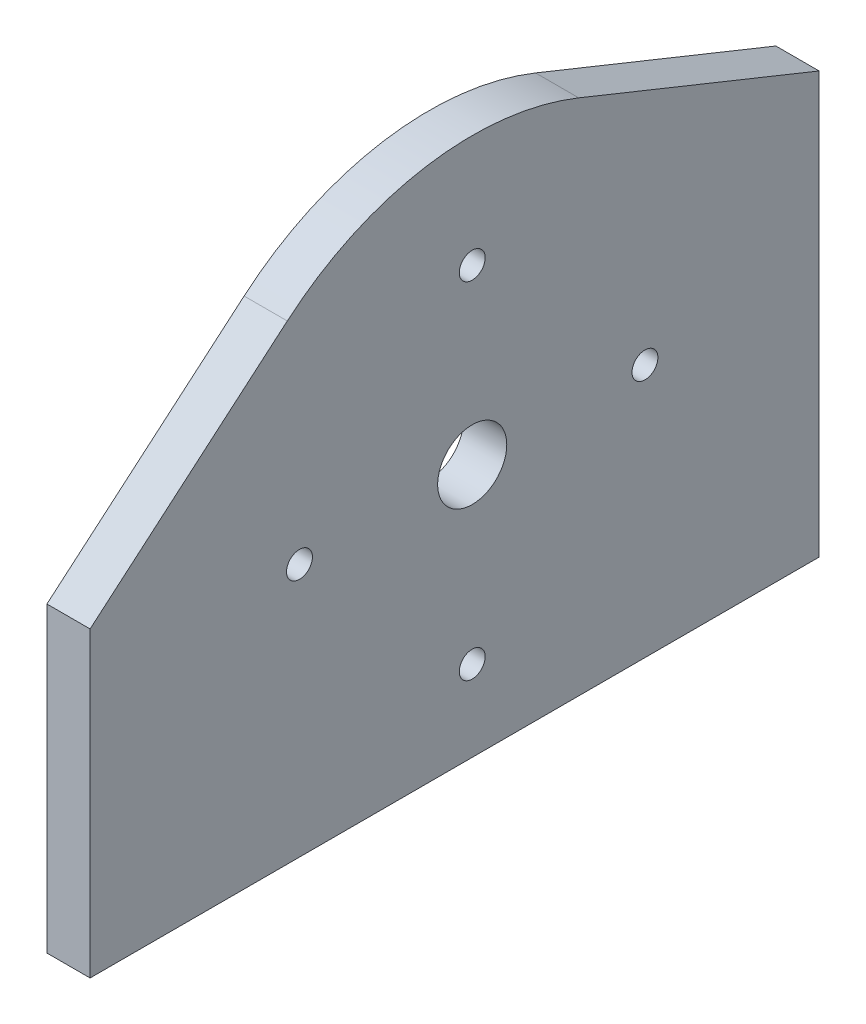
ISO-10303-21;
HEADER;
FILE_DESCRIPTION(('STEP AP214'),'2;1');
FILE_NAME('part.step','',(''),(''),'','','');
FILE_SCHEMA(('AUTOMOTIVE_DESIGN { 1 0 10303 214 1 1 1 1 }'));
ENDSEC;
DATA;
#1=APPLICATION_CONTEXT('core data for automotive mechanical design processes');
#2=APPLICATION_PROTOCOL_DEFINITION('international standard','automotive_design',2000,#1);
#3=PRODUCT_CONTEXT('',#1,'mechanical');
#4=PRODUCT('Part','Part','',(#3));
#5=PRODUCT_RELATED_PRODUCT_CATEGORY('part','',(#4));
#6=PRODUCT_DEFINITION_FORMATION('','',#4);
#7=PRODUCT_DEFINITION_CONTEXT('part definition',#1,'design');
#8=PRODUCT_DEFINITION('design','',#6,#7);
#9=PRODUCT_DEFINITION_SHAPE('','',#8);
#10=(LENGTH_UNIT() NAMED_UNIT(*) SI_UNIT(.MILLI.,.METRE.));
#11=(NAMED_UNIT(*) PLANE_ANGLE_UNIT() SI_UNIT($,.RADIAN.));
#12=(NAMED_UNIT(*) SI_UNIT($,.STERADIAN.) SOLID_ANGLE_UNIT());
#13=UNCERTAINTY_MEASURE_WITH_UNIT(LENGTH_MEASURE(1.E-05),#10,'distance_accuracy_value','');
#14=(GEOMETRIC_REPRESENTATION_CONTEXT(3) GLOBAL_UNCERTAINTY_ASSIGNED_CONTEXT((#13)) GLOBAL_UNIT_ASSIGNED_CONTEXT((#10,
#11,#12)) REPRESENTATION_CONTEXT('',''));
#15=CARTESIAN_POINT('',(0.,0.,0.));
#16=DIRECTION('',(0.,0.,1.));
#17=DIRECTION('',(1.,0.,0.));
#18=AXIS2_PLACEMENT_3D('',#15,#16,#17);
#19=CARTESIAN_POINT('',(5.,81.,0.));
#20=DIRECTION('',(-1.,0.,0.));
#21=DIRECTION('',(0.,0.,1.));
#22=AXIS2_PLACEMENT_3D('',#19,#20,#21);
#23=CYLINDRICAL_SURFACE('',#22,33.);
#24=CARTESIAN_POINT('',(0.,81.,0.));
#25=DIRECTION('',(1.,0.,0.));
#26=DIRECTION('',(0.,0.,-1.));
#27=AXIS2_PLACEMENT_3D('',#24,#25,#26);
#28=CIRCLE('',#27,33.);
#29=CARTESIAN_POINT('',(0.,111.608123513055,-12.3346169380967));
#30=VERTEX_POINT('',#29);
#31=CARTESIAN_POINT('',(0.,106.111358555441,21.4107372946394));
#32=VERTEX_POINT('',#31);
#33=EDGE_CURVE('E121',#30,#32,#28,.T.);
#34=ORIENTED_EDGE('',*,*,#33,.T.);
#35=DIRECTION('',(-1.,0.,0.));
#36=VECTOR('',#35,1.);
#37=CARTESIAN_POINT('',(5.,106.111358555441,21.4107372946394));
#38=LINE('',#37,#36);
#39=CARTESIAN_POINT('',(5.,106.111358555441,21.4107372946394));
#40=VERTEX_POINT('',#39);
#41=EDGE_CURVE('E11',#40,#32,#38,.T.);
#42=ORIENTED_EDGE('',*,*,#41,.F.);
#43=CARTESIAN_POINT('',(5.,81.,0.));
#44=DIRECTION('',(1.,0.,0.));
#45=DIRECTION('',(0.,0.,-1.));
#46=AXIS2_PLACEMENT_3D('',#43,#44,#45);
#47=CIRCLE('',#46,33.);
#48=CARTESIAN_POINT('',(5.,111.608123513055,-12.3346169380967));
#49=VERTEX_POINT('',#48);
#50=EDGE_CURVE('E132',#49,#40,#47,.T.);
#51=ORIENTED_EDGE('',*,*,#50,.F.);
#52=DIRECTION('',(-1.,0.,0.));
#53=VECTOR('',#52,1.);
#54=CARTESIAN_POINT('',(5.,111.608123513055,-12.3346169380967));
#55=LINE('',#54,#53);
#56=EDGE_CURVE('E117',#49,#30,#55,.T.);
#57=ORIENTED_EDGE('',*,*,#56,.T.);
#58=EDGE_LOOP('',(#34,#42,#51,#57));
#59=FACE_BOUND('',#58,.T.);
#60=ADVANCED_FACE('F37',(#59),#23,.T.);
#61=CARTESIAN_POINT('',(5.,86.6470519239509,44.2392450723134));
#62=DIRECTION('',(0.,-0.760950259255798,-0.64881022104968));
#63=DIRECTION('',(0.,0.64881022104968,-0.760950259255798));
#64=AXIS2_PLACEMENT_3D('',#61,#62,#63);
#65=PLANE('',#64);
#66=DIRECTION('',(0.,-0.64881022104968,0.760950259255798));
#67=VECTOR('',#66,1.);
#68=CARTESIAN_POINT('',(0.,86.6470519239509,44.2392450723134));
#69=LINE('',#68,#67);
#70=CARTESIAN_POINT('',(0.,86.6470519239509,44.2392450723134));
#71=VERTEX_POINT('',#70);
#72=EDGE_CURVE('E124',#32,#71,#69,.T.);
#73=ORIENTED_EDGE('',*,*,#72,.T.);
#74=DIRECTION('',(-1.,0.,0.));
#75=VECTOR('',#74,1.);
#76=CARTESIAN_POINT('',(5.,86.6470519239509,44.2392450723134));
#77=LINE('',#76,#75);
#78=CARTESIAN_POINT('',(5.,86.6470519239509,44.2392450723134));
#79=VERTEX_POINT('',#78);
#80=EDGE_CURVE('E45',#79,#71,#77,.T.);
#81=ORIENTED_EDGE('',*,*,#80,.F.);
#82=DIRECTION('',(0.,-0.64881022104968,0.760950259255798));
#83=VECTOR('',#82,1.);
#84=CARTESIAN_POINT('',(5.,86.6470519239509,44.2392450723134));
#85=LINE('',#84,#83);
#86=EDGE_CURVE('E90',#40,#79,#85,.T.);
#87=ORIENTED_EDGE('',*,*,#86,.F.);
#88=ORIENTED_EDGE('',*,*,#41,.T.);
#89=EDGE_LOOP('',(#73,#81,#87,#88));
#90=FACE_BOUND('',#89,.T.);
#91=ADVANCED_FACE('F157',(#90),#65,.F.);
#92=CARTESIAN_POINT('',(5.,86.6470519239509,44.2392450723134));
#93=DIRECTION('',(0.,0.,-1.));
#94=DIRECTION('',(0.,1.,0.));
#95=AXIS2_PLACEMENT_3D('',#92,#93,#94);
#96=PLANE('',#95);
#97=DIRECTION('',(0.,-1.,0.));
#98=VECTOR('',#97,1.);
#99=CARTESIAN_POINT('',(0.,86.6470519239509,44.2392450723134));
#100=LINE('',#99,#98);
#101=CARTESIAN_POINT('',(0.,51.6470519239509,44.2392450723133));
#102=VERTEX_POINT('',#101);
#103=EDGE_CURVE('E127',#71,#102,#100,.T.);
#104=ORIENTED_EDGE('',*,*,#103,.T.);
#105=DIRECTION('',(-1.,0.,0.));
#106=VECTOR('',#105,1.);
#107=CARTESIAN_POINT('',(5.,51.6470519239509,44.2392450723133));
#108=LINE('',#107,#106);
#109=CARTESIAN_POINT('',(5.,51.6470519239509,44.2392450723133));
#110=VERTEX_POINT('',#109);
#111=EDGE_CURVE('E112',#110,#102,#108,.T.);
#112=ORIENTED_EDGE('',*,*,#111,.F.);
#113=DIRECTION('',(0.,-1.,0.));
#114=VECTOR('',#113,1.);
#115=CARTESIAN_POINT('',(5.,86.6470519239509,44.2392450723134));
#116=LINE('',#115,#114);
#117=EDGE_CURVE('E103',#79,#110,#116,.T.);
#118=ORIENTED_EDGE('',*,*,#117,.F.);
#119=ORIENTED_EDGE('',*,*,#80,.T.);
#120=EDGE_LOOP('',(#104,#112,#118,#119));
#121=FACE_BOUND('',#120,.T.);
#122=ADVANCED_FACE('F138',(#121),#96,.F.);
#123=CARTESIAN_POINT('',(5.,51.6470519239509,44.2392450723133));
#124=DIRECTION('',(0.,1.,0.));
#125=DIRECTION('',(0.,0.,1.));
#126=AXIS2_PLACEMENT_3D('',#123,#124,#125);
#127=PLANE('',#126);
#128=DIRECTION('',(0.,0.,-1.));
#129=VECTOR('',#128,1.);
#130=CARTESIAN_POINT('',(0.,51.6470519239509,44.2392450723133));
#131=LINE('',#130,#129);
#132=CARTESIAN_POINT('',(0.,51.6470519239509,-40.1601837681465));
#133=VERTEX_POINT('',#132);
#134=EDGE_CURVE('E111',#102,#133,#131,.T.);
#135=ORIENTED_EDGE('',*,*,#134,.T.);
#136=DIRECTION('',(-1.,0.,0.));
#137=VECTOR('',#136,1.);
#138=CARTESIAN_POINT('',(5.,51.6470519239509,-40.1601837681465));
#139=LINE('',#138,#137);
#140=CARTESIAN_POINT('',(5.,51.6470519239509,-40.1601837681465));
#141=VERTEX_POINT('',#140);
#142=EDGE_CURVE('E108',#141,#133,#139,.T.);
#143=ORIENTED_EDGE('',*,*,#142,.F.);
#144=DIRECTION('',(0.,0.,-1.));
#145=VECTOR('',#144,1.);
#146=CARTESIAN_POINT('',(5.,51.6470519239509,44.2392450723133));
#147=LINE('',#146,#145);
#148=EDGE_CURVE('E97',#110,#141,#147,.T.);
#149=ORIENTED_EDGE('',*,*,#148,.F.);
#150=ORIENTED_EDGE('',*,*,#111,.T.);
#151=EDGE_LOOP('',(#135,#143,#149,#150));
#152=FACE_BOUND('',#151,.T.);
#153=ADVANCED_FACE('F109',(#152),#127,.F.);
#154=CARTESIAN_POINT('',(5.,51.6470519239509,-40.1601837681465));
#155=DIRECTION('',(0.,0.,1.));
#156=DIRECTION('',(0.,-1.,0.));
#157=AXIS2_PLACEMENT_3D('',#154,#155,#156);
#158=PLANE('',#157);
#159=DIRECTION('',(0.,1.,0.));
#160=VECTOR('',#159,1.);
#161=CARTESIAN_POINT('',(0.,51.6470519239509,-40.1601837681465));
#162=LINE('',#161,#160);
#163=CARTESIAN_POINT('',(0.,100.394835387512,-40.1601837681464));
#164=VERTEX_POINT('',#163);
#165=EDGE_CURVE('E76',#133,#164,#162,.T.);
#166=ORIENTED_EDGE('',*,*,#165,.T.);
#167=DIRECTION('',(-1.,0.,0.));
#168=VECTOR('',#167,1.);
#169=CARTESIAN_POINT('',(5.,100.394835387512,-40.1601837681464));
#170=LINE('',#169,#168);
#171=CARTESIAN_POINT('',(5.,100.394835387512,-40.1601837681464));
#172=VERTEX_POINT('',#171);
#173=EDGE_CURVE('E113',#172,#164,#170,.T.);
#174=ORIENTED_EDGE('',*,*,#173,.F.);
#175=DIRECTION('',(0.,1.,0.));
#176=VECTOR('',#175,1.);
#177=CARTESIAN_POINT('',(5.,51.6470519239509,-40.1601837681465));
#178=LINE('',#177,#176);
#179=EDGE_CURVE('E101',#141,#172,#178,.T.);
#180=ORIENTED_EDGE('',*,*,#179,.F.);
#181=ORIENTED_EDGE('',*,*,#142,.T.);
#182=EDGE_LOOP('',(#166,#174,#180,#181));
#183=FACE_BOUND('',#182,.T.);
#184=ADVANCED_FACE('F115',(#183),#158,.F.);
#185=CARTESIAN_POINT('',(5.,100.394835387512,-40.1601837681464));
#186=DIRECTION('',(0.,-0.927518894334992,0.37377627085142));
#187=DIRECTION('',(0.,-0.37377627085142,-0.927518894334992));
#188=AXIS2_PLACEMENT_3D('',#185,#186,#187);
#189=PLANE('',#188);
#190=DIRECTION('',(0.,0.37377627085142,0.927518894334992));
#191=VECTOR('',#190,1.);
#192=CARTESIAN_POINT('',(0.,100.394835387512,-40.1601837681464));
#193=LINE('',#192,#191);
#194=EDGE_CURVE('E82',#164,#30,#193,.T.);
#195=ORIENTED_EDGE('',*,*,#194,.T.);
#196=ORIENTED_EDGE('',*,*,#56,.F.);
#197=DIRECTION('',(0.,0.37377627085142,0.927518894334992));
#198=VECTOR('',#197,1.);
#199=CARTESIAN_POINT('',(5.,100.394835387512,-40.1601837681464));
#200=LINE('',#199,#198);
#201=EDGE_CURVE('E53',#172,#49,#200,.T.);
#202=ORIENTED_EDGE('',*,*,#201,.F.);
#203=ORIENTED_EDGE('',*,*,#173,.T.);
#204=EDGE_LOOP('',(#195,#196,#202,#203));
#205=FACE_BOUND('',#204,.T.);
#206=ADVANCED_FACE('F145',(#205),#189,.F.);
#207=CARTESIAN_POINT('',(5.,81.,0.));
#208=DIRECTION('',(1.,0.,0.));
#209=DIRECTION('',(0.,0.,-1.));
#210=AXIS2_PLACEMENT_3D('',#207,#208,#209);
#211=PLANE('',#210);
#212=CARTESIAN_POINT('',(5.,81.,0.));
#213=DIRECTION('',(1.,0.,0.));
#214=DIRECTION('',(0.,0.,-1.));
#215=AXIS2_PLACEMENT_3D('',#212,#213,#214);
#216=CIRCLE('',#215,4.);
#217=CARTESIAN_POINT('',(5.,81.,-4.));
#218=VERTEX_POINT('',#217);
#219=EDGE_CURVE('E250',#218,#218,#216,.T.);
#220=ORIENTED_EDGE('',*,*,#219,.F.);
#221=EDGE_LOOP('',(#220));
#222=FACE_BOUND('',#221,.T.);
#223=CARTESIAN_POINT('',(5.,81.,20.));
#224=DIRECTION('',(1.,0.,0.));
#225=DIRECTION('',(0.,0.,-1.));
#226=AXIS2_PLACEMENT_3D('',#223,#224,#225);
#227=CIRCLE('',#226,1.5);
#228=CARTESIAN_POINT('',(5.,81.,18.5));
#229=VERTEX_POINT('',#228);
#230=EDGE_CURVE('E258',#229,#229,#227,.T.);
#231=ORIENTED_EDGE('',*,*,#230,.F.);
#232=EDGE_LOOP('',(#231));
#233=FACE_BOUND('',#232,.T.);
#234=CARTESIAN_POINT('',(5.,81.,-20.));
#235=DIRECTION('',(1.,0.,0.));
#236=DIRECTION('',(0.,0.,-1.));
#237=AXIS2_PLACEMENT_3D('',#234,#235,#236);
#238=CIRCLE('',#237,1.5);
#239=CARTESIAN_POINT('',(5.,81.,-21.5));
#240=VERTEX_POINT('',#239);
#241=EDGE_CURVE('E264',#240,#240,#238,.T.);
#242=ORIENTED_EDGE('',*,*,#241,.F.);
#243=EDGE_LOOP('',(#242));
#244=FACE_BOUND('',#243,.T.);
#245=CARTESIAN_POINT('',(5.,61.,0.));
#246=DIRECTION('',(1.,0.,0.));
#247=DIRECTION('',(0.,0.,-1.));
#248=AXIS2_PLACEMENT_3D('',#245,#246,#247);
#249=CIRCLE('',#248,1.5);
#250=CARTESIAN_POINT('',(5.,61.,-1.50000000000001));
#251=VERTEX_POINT('',#250);
#252=EDGE_CURVE('E270',#251,#251,#249,.T.);
#253=ORIENTED_EDGE('',*,*,#252,.F.);
#254=EDGE_LOOP('',(#253));
#255=FACE_BOUND('',#254,.T.);
#256=CARTESIAN_POINT('',(5.,101.,0.));
#257=DIRECTION('',(1.,0.,0.));
#258=DIRECTION('',(0.,0.,-1.));
#259=AXIS2_PLACEMENT_3D('',#256,#257,#258);
#260=CIRCLE('',#259,1.5);
#261=CARTESIAN_POINT('',(5.,101.,-1.5));
#262=VERTEX_POINT('',#261);
#263=EDGE_CURVE('E125',#262,#262,#260,.T.);
#264=ORIENTED_EDGE('',*,*,#263,.F.);
#265=EDGE_LOOP('',(#264));
#266=FACE_BOUND('',#265,.T.);
#267=ORIENTED_EDGE('',*,*,#50,.T.);
#268=ORIENTED_EDGE('',*,*,#86,.T.);
#269=ORIENTED_EDGE('',*,*,#117,.T.);
#270=ORIENTED_EDGE('',*,*,#148,.T.);
#271=ORIENTED_EDGE('',*,*,#179,.T.);
#272=ORIENTED_EDGE('',*,*,#201,.T.);
#273=EDGE_LOOP('',(#267,#268,#269,#270,#271,#272));
#274=FACE_BOUND('',#273,.T.);
#275=ADVANCED_FACE('F99',(#222,#233,#244,#255,#266,#274),#211,.T.);
#276=CARTESIAN_POINT('',(0.,81.,0.));
#277=DIRECTION('',(1.,0.,0.));
#278=DIRECTION('',(0.,0.,-1.));
#279=AXIS2_PLACEMENT_3D('',#276,#277,#278);
#280=PLANE('',#279);
#281=CARTESIAN_POINT('',(0.,81.,0.));
#282=DIRECTION('',(1.,0.,0.));
#283=DIRECTION('',(0.,0.,-1.));
#284=AXIS2_PLACEMENT_3D('',#281,#282,#283);
#285=CIRCLE('',#284,4.);
#286=CARTESIAN_POINT('',(0.,81.,-4.));
#287=VERTEX_POINT('',#286);
#288=EDGE_CURVE('E253',#287,#287,#285,.T.);
#289=ORIENTED_EDGE('',*,*,#288,.T.);
#290=EDGE_LOOP('',(#289));
#291=FACE_BOUND('',#290,.T.);
#292=CARTESIAN_POINT('',(0.,81.,20.));
#293=DIRECTION('',(1.,0.,0.));
#294=DIRECTION('',(0.,0.,-1.));
#295=AXIS2_PLACEMENT_3D('',#292,#293,#294);
#296=CIRCLE('',#295,1.5);
#297=CARTESIAN_POINT('',(0.,81.,18.5));
#298=VERTEX_POINT('',#297);
#299=EDGE_CURVE('E255',#298,#298,#296,.T.);
#300=ORIENTED_EDGE('',*,*,#299,.T.);
#301=EDGE_LOOP('',(#300));
#302=FACE_BOUND('',#301,.T.);
#303=CARTESIAN_POINT('',(0.,81.,-20.));
#304=DIRECTION('',(1.,0.,0.));
#305=DIRECTION('',(0.,0.,-1.));
#306=AXIS2_PLACEMENT_3D('',#303,#304,#305);
#307=CIRCLE('',#306,1.5);
#308=CARTESIAN_POINT('',(0.,81.,-21.5));
#309=VERTEX_POINT('',#308);
#310=EDGE_CURVE('E261',#309,#309,#307,.T.);
#311=ORIENTED_EDGE('',*,*,#310,.T.);
#312=EDGE_LOOP('',(#311));
#313=FACE_BOUND('',#312,.T.);
#314=CARTESIAN_POINT('',(0.,61.,0.));
#315=DIRECTION('',(1.,0.,0.));
#316=DIRECTION('',(0.,0.,-1.));
#317=AXIS2_PLACEMENT_3D('',#314,#315,#316);
#318=CIRCLE('',#317,1.5);
#319=CARTESIAN_POINT('',(0.,61.,-1.50000000000001));
#320=VERTEX_POINT('',#319);
#321=EDGE_CURVE('E267',#320,#320,#318,.T.);
#322=ORIENTED_EDGE('',*,*,#321,.T.);
#323=EDGE_LOOP('',(#322));
#324=FACE_BOUND('',#323,.T.);
#325=CARTESIAN_POINT('',(0.,101.,0.));
#326=DIRECTION('',(1.,0.,0.));
#327=DIRECTION('',(0.,0.,-1.));
#328=AXIS2_PLACEMENT_3D('',#325,#326,#327);
#329=CIRCLE('',#328,1.5);
#330=CARTESIAN_POINT('',(0.,101.,-1.5));
#331=VERTEX_POINT('',#330);
#332=EDGE_CURVE('E273',#331,#331,#329,.T.);
#333=ORIENTED_EDGE('',*,*,#332,.T.);
#334=EDGE_LOOP('',(#333));
#335=FACE_BOUND('',#334,.T.);
#336=ORIENTED_EDGE('',*,*,#33,.F.);
#337=ORIENTED_EDGE('',*,*,#194,.F.);
#338=ORIENTED_EDGE('',*,*,#165,.F.);
#339=ORIENTED_EDGE('',*,*,#134,.F.);
#340=ORIENTED_EDGE('',*,*,#103,.F.);
#341=ORIENTED_EDGE('',*,*,#72,.F.);
#342=EDGE_LOOP('',(#336,#337,#338,#339,#340,#341));
#343=FACE_BOUND('',#342,.T.);
#344=ADVANCED_FACE('F141',(#291,#302,#313,#324,#335,#343),#280,.F.);
#345=CARTESIAN_POINT('',(5.,101.,0.));
#346=DIRECTION('',(-1.,0.,0.));
#347=DIRECTION('',(0.,0.,1.));
#348=AXIS2_PLACEMENT_3D('',#345,#346,#347);
#349=CYLINDRICAL_SURFACE('',#348,1.5);
#350=ORIENTED_EDGE('',*,*,#263,.T.);
#351=EDGE_LOOP('',(#350));
#352=FACE_BOUND('',#351,.T.);
#353=ORIENTED_EDGE('',*,*,#332,.F.);
#354=EDGE_LOOP('',(#353));
#355=FACE_BOUND('',#354,.T.);
#356=ADVANCED_FACE('F194',(#352,#355),#349,.F.);
#357=CARTESIAN_POINT('',(5.,61.,0.));
#358=DIRECTION('',(-1.,0.,0.));
#359=DIRECTION('',(0.,0.,1.));
#360=AXIS2_PLACEMENT_3D('',#357,#358,#359);
#361=CYLINDRICAL_SURFACE('',#360,1.5);
#362=ORIENTED_EDGE('',*,*,#252,.T.);
#363=EDGE_LOOP('',(#362));
#364=FACE_BOUND('',#363,.T.);
#365=ORIENTED_EDGE('',*,*,#321,.F.);
#366=EDGE_LOOP('',(#365));
#367=FACE_BOUND('',#366,.T.);
#368=ADVANCED_FACE('F203',(#364,#367),#361,.F.);
#369=CARTESIAN_POINT('',(5.,81.,-20.));
#370=DIRECTION('',(-1.,0.,0.));
#371=DIRECTION('',(0.,0.,1.));
#372=AXIS2_PLACEMENT_3D('',#369,#370,#371);
#373=CYLINDRICAL_SURFACE('',#372,1.5);
#374=ORIENTED_EDGE('',*,*,#241,.T.);
#375=EDGE_LOOP('',(#374));
#376=FACE_BOUND('',#375,.T.);
#377=ORIENTED_EDGE('',*,*,#310,.F.);
#378=EDGE_LOOP('',(#377));
#379=FACE_BOUND('',#378,.T.);
#380=ADVANCED_FACE('F213',(#376,#379),#373,.F.);
#381=CARTESIAN_POINT('',(5.,81.,20.));
#382=DIRECTION('',(-1.,0.,0.));
#383=DIRECTION('',(0.,0.,1.));
#384=AXIS2_PLACEMENT_3D('',#381,#382,#383);
#385=CYLINDRICAL_SURFACE('',#384,1.5);
#386=ORIENTED_EDGE('',*,*,#230,.T.);
#387=EDGE_LOOP('',(#386));
#388=FACE_BOUND('',#387,.T.);
#389=ORIENTED_EDGE('',*,*,#299,.F.);
#390=EDGE_LOOP('',(#389));
#391=FACE_BOUND('',#390,.T.);
#392=ADVANCED_FACE('F223',(#388,#391),#385,.F.);
#393=CARTESIAN_POINT('',(5.,81.,0.));
#394=DIRECTION('',(-1.,0.,0.));
#395=DIRECTION('',(0.,0.,1.));
#396=AXIS2_PLACEMENT_3D('',#393,#394,#395);
#397=CYLINDRICAL_SURFACE('',#396,4.);
#398=ORIENTED_EDGE('',*,*,#219,.T.);
#399=EDGE_LOOP('',(#398));
#400=FACE_BOUND('',#399,.T.);
#401=ORIENTED_EDGE('',*,*,#288,.F.);
#402=EDGE_LOOP('',(#401));
#403=FACE_BOUND('',#402,.T.);
#404=ADVANCED_FACE('F233',(#400,#403),#397,.F.);
#405=CLOSED_SHELL('',(#60,#91,#122,#153,#184,#206,#275,#344,#356,#368,#380,#392,#404));
#406=MANIFOLD_SOLID_BREP('B2',#405);
#407=ADVANCED_BREP_SHAPE_REPRESENTATION('',(#18,#406),#14);
#408=SHAPE_DEFINITION_REPRESENTATION(#9,#407);
ENDSEC;
END-ISO-10303-21;
